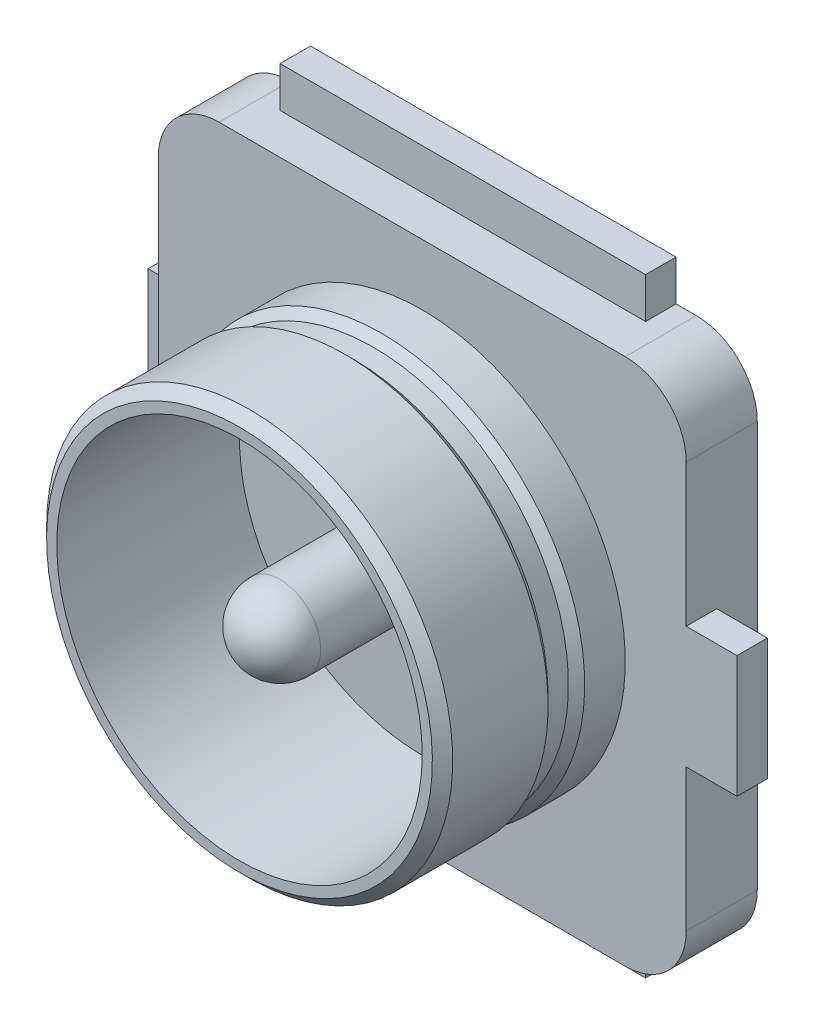
ISO-10303-21;
HEADER;
FILE_DESCRIPTION(('STEP AP214'),'2;1');
FILE_NAME('part.step','',(''),(''),'','','');
FILE_SCHEMA(('AUTOMOTIVE_DESIGN { 1 0 10303 214 1 1 1 1 }'));
ENDSEC;
DATA;
#1=APPLICATION_CONTEXT('core data for automotive mechanical design processes');
#2=APPLICATION_PROTOCOL_DEFINITION('international standard','automotive_design',2000,#1);
#3=PRODUCT_CONTEXT('',#1,'mechanical');
#4=PRODUCT('Part','Part','',(#3));
#5=PRODUCT_RELATED_PRODUCT_CATEGORY('part','',(#4));
#6=PRODUCT_DEFINITION_FORMATION('','',#4);
#7=PRODUCT_DEFINITION_CONTEXT('part definition',#1,'design');
#8=PRODUCT_DEFINITION('design','',#6,#7);
#9=PRODUCT_DEFINITION_SHAPE('','',#8);
#10=(LENGTH_UNIT() NAMED_UNIT(*) SI_UNIT(.MILLI.,.METRE.));
#11=(NAMED_UNIT(*) PLANE_ANGLE_UNIT() SI_UNIT($,.RADIAN.));
#12=(NAMED_UNIT(*) SI_UNIT($,.STERADIAN.) SOLID_ANGLE_UNIT());
#13=UNCERTAINTY_MEASURE_WITH_UNIT(LENGTH_MEASURE(1.E-05),#10,'distance_accuracy_value','');
#14=(GEOMETRIC_REPRESENTATION_CONTEXT(3) GLOBAL_UNCERTAINTY_ASSIGNED_CONTEXT((#13)) GLOBAL_UNIT_ASSIGNED_CONTEXT((#10,
#11,#12)) REPRESENTATION_CONTEXT('',''));
#15=CARTESIAN_POINT('',(0.,0.,0.));
#16=DIRECTION('',(0.,0.,1.));
#17=DIRECTION('',(1.,0.,0.));
#18=AXIS2_PLACEMENT_3D('',#15,#16,#17);
#19=CARTESIAN_POINT('',(1.3,-1.3,0.));
#20=DIRECTION('',(1.,0.,0.));
#21=DIRECTION('',(0.,1.,0.));
#22=AXIS2_PLACEMENT_3D('',#19,#20,#21);
#23=PLANE('',#22);
#24=DIRECTION('',(0.,1.,0.));
#25=VECTOR('',#24,1.);
#26=CARTESIAN_POINT('',(1.3,-1.3,0.2));
#27=LINE('',#26,#25);
#28=CARTESIAN_POINT('',(1.3,0.3,0.2));
#29=VERTEX_POINT('',#28);
#30=CARTESIAN_POINT('',(1.3,-0.3,0.2));
#31=VERTEX_POINT('',#30);
#32=EDGE_CURVE('E103',#29,#31,#27,.F.);
#33=ORIENTED_EDGE('',*,*,#32,.T.);
#34=DIRECTION('',(0.,0.,1.));
#35=VECTOR('',#34,1.);
#36=CARTESIAN_POINT('',(1.3,-0.3,0.));
#37=LINE('',#36,#35);
#38=CARTESIAN_POINT('',(1.3,-0.3,0.35));
#39=VERTEX_POINT('',#38);
#40=EDGE_CURVE('E137',#31,#39,#37,.T.);
#41=ORIENTED_EDGE('',*,*,#40,.T.);
#42=DIRECTION('',(0.,1.,0.));
#43=VECTOR('',#42,1.);
#44=CARTESIAN_POINT('',(1.3,-1.3,0.35));
#45=LINE('',#44,#43);
#46=CARTESIAN_POINT('',(1.3,-1.,0.35));
#47=VERTEX_POINT('',#46);
#48=EDGE_CURVE('E264',#39,#47,#45,.F.);
#49=ORIENTED_EDGE('',*,*,#48,.T.);
#50=DIRECTION('',(0.,0.,1.));
#51=VECTOR('',#50,1.);
#52=CARTESIAN_POINT('',(1.3,-1.,0.));
#53=LINE('',#52,#51);
#54=CARTESIAN_POINT('',(1.3,-1.,0.));
#55=VERTEX_POINT('',#54);
#56=EDGE_CURVE('E262',#47,#55,#53,.F.);
#57=ORIENTED_EDGE('',*,*,#56,.T.);
#58=DIRECTION('',(0.,1.,0.));
#59=VECTOR('',#58,1.);
#60=CARTESIAN_POINT('',(1.3,-1.3,0.));
#61=LINE('',#60,#59);
#62=CARTESIAN_POINT('',(1.3,1.,0.));
#63=VERTEX_POINT('',#62);
#64=EDGE_CURVE('E182',#55,#63,#61,.T.);
#65=ORIENTED_EDGE('',*,*,#64,.T.);
#66=DIRECTION('',(0.,0.,1.));
#67=VECTOR('',#66,1.);
#68=CARTESIAN_POINT('',(1.3,1.,0.));
#69=LINE('',#68,#67);
#70=CARTESIAN_POINT('',(1.3,1.,0.35));
#71=VERTEX_POINT('',#70);
#72=EDGE_CURVE('E117',#63,#71,#69,.T.);
#73=ORIENTED_EDGE('',*,*,#72,.T.);
#74=DIRECTION('',(0.,1.,0.));
#75=VECTOR('',#74,1.);
#76=CARTESIAN_POINT('',(1.3,-1.3,0.35));
#77=LINE('',#76,#75);
#78=CARTESIAN_POINT('',(1.3,0.3,0.35));
#79=VERTEX_POINT('',#78);
#80=EDGE_CURVE('E111',#71,#79,#77,.F.);
#81=ORIENTED_EDGE('',*,*,#80,.T.);
#82=DIRECTION('',(0.,0.,1.));
#83=VECTOR('',#82,1.);
#84=CARTESIAN_POINT('',(1.3,0.3,0.));
#85=LINE('',#84,#83);
#86=EDGE_CURVE('E114',#79,#29,#85,.F.);
#87=ORIENTED_EDGE('',*,*,#86,.T.);
#88=EDGE_LOOP('',(#33,#41,#49,#57,#65,#73,#81,#87));
#89=FACE_BOUND('',#88,.T.);
#90=ADVANCED_FACE('F17',(#89),#23,.T.);
#91=CARTESIAN_POINT('',(-1.55,-0.3,0.));
#92=DIRECTION('',(0.,0.,1.));
#93=DIRECTION('',(1.,0.,0.));
#94=AXIS2_PLACEMENT_3D('',#91,#92,#93);
#95=PLANE('',#94);
#96=DIRECTION('',(-1.,0.,0.));
#97=VECTOR('',#96,1.);
#98=CARTESIAN_POINT('',(-1.55,0.3,0.));
#99=LINE('',#98,#97);
#100=CARTESIAN_POINT('',(-1.3,0.3,0.));
#101=VERTEX_POINT('',#100);
#102=CARTESIAN_POINT('',(-1.55,0.3,0.));
#103=VERTEX_POINT('',#102);
#104=EDGE_CURVE('E224',#101,#103,#99,.T.);
#105=ORIENTED_EDGE('',*,*,#104,.F.);
#106=DIRECTION('',(0.,1.,0.));
#107=VECTOR('',#106,1.);
#108=CARTESIAN_POINT('',(-1.3,-1.3,0.));
#109=LINE('',#108,#107);
#110=CARTESIAN_POINT('',(-1.3,1.,0.));
#111=VERTEX_POINT('',#110);
#112=EDGE_CURVE('E177',#111,#101,#109,.F.);
#113=ORIENTED_EDGE('',*,*,#112,.F.);
#114=CARTESIAN_POINT('',(-1.,1.,0.));
#115=DIRECTION('',(0.,0.,1.));
#116=DIRECTION('',(1.,0.,0.));
#117=AXIS2_PLACEMENT_3D('',#114,#115,#116);
#118=CIRCLE('',#117,0.3);
#119=CARTESIAN_POINT('',(-1.,1.3,0.));
#120=VERTEX_POINT('',#119);
#121=EDGE_CURVE('E174',#120,#111,#118,.T.);
#122=ORIENTED_EDGE('',*,*,#121,.F.);
#123=DIRECTION('',(1.,0.,0.));
#124=VECTOR('',#123,1.);
#125=CARTESIAN_POINT('',(-1.3,1.3,0.));
#126=LINE('',#125,#124);
#127=CARTESIAN_POINT('',(-0.9,1.3,0.));
#128=VERTEX_POINT('',#127);
#129=EDGE_CURVE('E178',#128,#120,#126,.F.);
#130=ORIENTED_EDGE('',*,*,#129,.F.);
#131=DIRECTION('',(0.,1.,0.));
#132=VECTOR('',#131,1.);
#133=CARTESIAN_POINT('',(-0.9,1.1,0.));
#134=LINE('',#133,#132);
#135=CARTESIAN_POINT('',(-0.9,1.5,0.));
#136=VERTEX_POINT('',#135);
#137=EDGE_CURVE('E244',#136,#128,#134,.F.);
#138=ORIENTED_EDGE('',*,*,#137,.F.);
#139=DIRECTION('',(-1.,0.,0.));
#140=VECTOR('',#139,1.);
#141=CARTESIAN_POINT('',(-0.9,1.5,0.));
#142=LINE('',#141,#140);
#143=CARTESIAN_POINT('',(0.9,1.5,0.));
#144=VERTEX_POINT('',#143);
#145=EDGE_CURVE('E369',#144,#136,#142,.T.);
#146=ORIENTED_EDGE('',*,*,#145,.F.);
#147=DIRECTION('',(0.,1.,0.));
#148=VECTOR('',#147,1.);
#149=CARTESIAN_POINT('',(0.9,1.1,0.));
#150=LINE('',#149,#148);
#151=CARTESIAN_POINT('',(0.9,1.3,0.));
#152=VERTEX_POINT('',#151);
#153=EDGE_CURVE('E248',#152,#144,#150,.T.);
#154=ORIENTED_EDGE('',*,*,#153,.F.);
#155=DIRECTION('',(1.,0.,0.));
#156=VECTOR('',#155,1.);
#157=CARTESIAN_POINT('',(-1.3,1.3,0.));
#158=LINE('',#157,#156);
#159=CARTESIAN_POINT('',(1.,1.3,0.));
#160=VERTEX_POINT('',#159);
#161=EDGE_CURVE('E181',#160,#152,#158,.F.);
#162=ORIENTED_EDGE('',*,*,#161,.F.);
#163=CARTESIAN_POINT('',(1.,1.,0.));
#164=DIRECTION('',(0.,0.,1.));
#165=DIRECTION('',(1.,0.,0.));
#166=AXIS2_PLACEMENT_3D('',#163,#164,#165);
#167=CIRCLE('',#166,0.3);
#168=EDGE_CURVE('E179',#63,#160,#167,.T.);
#169=ORIENTED_EDGE('',*,*,#168,.F.);
#170=ORIENTED_EDGE('',*,*,#64,.F.);
#171=CARTESIAN_POINT('',(1.,-1.,0.));
#172=DIRECTION('',(0.,0.,1.));
#173=DIRECTION('',(1.,0.,0.));
#174=AXIS2_PLACEMENT_3D('',#171,#172,#173);
#175=CIRCLE('',#174,0.3);
#176=CARTESIAN_POINT('',(1.,-1.3,0.));
#177=VERTEX_POINT('',#176);
#178=EDGE_CURVE('E183',#177,#55,#175,.T.);
#179=ORIENTED_EDGE('',*,*,#178,.F.);
#180=DIRECTION('',(1.,0.,0.));
#181=VECTOR('',#180,1.);
#182=CARTESIAN_POINT('',(-1.3,-1.3,0.));
#183=LINE('',#182,#181);
#184=CARTESIAN_POINT('',(0.9,-1.3,0.));
#185=VERTEX_POINT('',#184);
#186=EDGE_CURVE('E185',#185,#177,#183,.T.);
#187=ORIENTED_EDGE('',*,*,#186,.F.);
#188=DIRECTION('',(0.,1.,0.));
#189=VECTOR('',#188,1.);
#190=CARTESIAN_POINT('',(0.9,-1.5,0.));
#191=LINE('',#190,#189);
#192=CARTESIAN_POINT('',(0.9,-1.5,0.));
#193=VERTEX_POINT('',#192);
#194=EDGE_CURVE('E259',#193,#185,#191,.T.);
#195=ORIENTED_EDGE('',*,*,#194,.F.);
#196=DIRECTION('',(-1.,0.,0.));
#197=VECTOR('',#196,1.);
#198=CARTESIAN_POINT('',(-0.9,-1.5,0.));
#199=LINE('',#198,#197);
#200=CARTESIAN_POINT('',(-0.9,-1.5,0.));
#201=VERTEX_POINT('',#200);
#202=EDGE_CURVE('E375',#193,#201,#199,.T.);
#203=ORIENTED_EDGE('',*,*,#202,.T.);
#204=DIRECTION('',(0.,1.,0.));
#205=VECTOR('',#204,1.);
#206=CARTESIAN_POINT('',(-0.9,-1.5,0.));
#207=LINE('',#206,#205);
#208=CARTESIAN_POINT('',(-0.9,-1.3,0.));
#209=VERTEX_POINT('',#208);
#210=EDGE_CURVE('E275',#209,#201,#207,.F.);
#211=ORIENTED_EDGE('',*,*,#210,.F.);
#212=DIRECTION('',(1.,0.,0.));
#213=VECTOR('',#212,1.);
#214=CARTESIAN_POINT('',(-1.3,-1.3,0.));
#215=LINE('',#214,#213);
#216=CARTESIAN_POINT('',(-1.,-1.3,0.));
#217=VERTEX_POINT('',#216);
#218=EDGE_CURVE('E191',#217,#209,#215,.T.);
#219=ORIENTED_EDGE('',*,*,#218,.F.);
#220=CARTESIAN_POINT('',(-1.,-1.,0.));
#221=DIRECTION('',(0.,0.,1.));
#222=DIRECTION('',(1.,0.,0.));
#223=AXIS2_PLACEMENT_3D('',#220,#221,#222);
#224=CIRCLE('',#223,0.3);
#225=CARTESIAN_POINT('',(-1.3,-1.,0.));
#226=VERTEX_POINT('',#225);
#227=EDGE_CURVE('E20',#226,#217,#224,.T.);
#228=ORIENTED_EDGE('',*,*,#227,.F.);
#229=DIRECTION('',(0.,1.,0.));
#230=VECTOR('',#229,1.);
#231=CARTESIAN_POINT('',(-1.3,-1.3,0.));
#232=LINE('',#231,#230);
#233=CARTESIAN_POINT('',(-1.3,-0.3,0.));
#234=VERTEX_POINT('',#233);
#235=EDGE_CURVE('E205',#234,#226,#232,.F.);
#236=ORIENTED_EDGE('',*,*,#235,.F.);
#237=DIRECTION('',(-1.,0.,0.));
#238=VECTOR('',#237,1.);
#239=CARTESIAN_POINT('',(-1.55,-0.3,0.));
#240=LINE('',#239,#238);
#241=CARTESIAN_POINT('',(-1.55,-0.3,0.));
#242=VERTEX_POINT('',#241);
#243=EDGE_CURVE('E210',#234,#242,#240,.T.);
#244=ORIENTED_EDGE('',*,*,#243,.T.);
#245=DIRECTION('',(0.,1.,0.));
#246=VECTOR('',#245,1.);
#247=CARTESIAN_POINT('',(-1.55,-0.3,0.));
#248=LINE('',#247,#246);
#249=EDGE_CURVE('E247',#242,#103,#248,.T.);
#250=ORIENTED_EDGE('',*,*,#249,.T.);
#251=EDGE_LOOP('',(#105,#113,#122,#130,#138,#146,#154,#162,#169,#170,#179,#187,#195,#203,#211,
#219,#228,#236,#244,#250));
#252=FACE_BOUND('',#251,.T.);
#253=ADVANCED_FACE('F401',(#252),#95,.F.);
#254=CARTESIAN_POINT('',(-1.55,-0.3,0.));
#255=DIRECTION('',(1.,0.,0.));
#256=DIRECTION('',(0.,1.,0.));
#257=AXIS2_PLACEMENT_3D('',#254,#255,#256);
#258=PLANE('',#257);
#259=DIRECTION('',(0.,0.,1.));
#260=VECTOR('',#259,1.);
#261=CARTESIAN_POINT('',(-1.55,0.3,0.));
#262=LINE('',#261,#260);
#263=CARTESIAN_POINT('',(-1.55,0.3,0.15));
#264=VERTEX_POINT('',#263);
#265=EDGE_CURVE('E227',#103,#264,#262,.T.);
#266=ORIENTED_EDGE('',*,*,#265,.F.);
#267=ORIENTED_EDGE('',*,*,#249,.F.);
#268=DIRECTION('',(0.,0.,1.));
#269=VECTOR('',#268,1.);
#270=CARTESIAN_POINT('',(-1.55,-0.3,0.));
#271=LINE('',#270,#269);
#272=CARTESIAN_POINT('',(-1.55,-0.3,0.15));
#273=VERTEX_POINT('',#272);
#274=EDGE_CURVE('E213',#242,#273,#271,.T.);
#275=ORIENTED_EDGE('',*,*,#274,.T.);
#276=DIRECTION('',(0.,1.,0.));
#277=VECTOR('',#276,1.);
#278=CARTESIAN_POINT('',(-1.55,-0.3,0.15));
#279=LINE('',#278,#277);
#280=EDGE_CURVE('E362',#264,#273,#279,.F.);
#281=ORIENTED_EDGE('',*,*,#280,.F.);
#282=EDGE_LOOP('',(#266,#267,#275,#281));
#283=FACE_BOUND('',#282,.T.);
#284=ADVANCED_FACE('F473',(#283),#258,.F.);
#285=CARTESIAN_POINT('',(-0.9,-1.5,0.));
#286=DIRECTION('',(0.,1.,0.));
#287=DIRECTION('',(-1.,0.,0.));
#288=AXIS2_PLACEMENT_3D('',#285,#286,#287);
#289=PLANE('',#288);
#290=DIRECTION('',(1.,0.,0.));
#291=VECTOR('',#290,1.);
#292=CARTESIAN_POINT('',(-0.9,-1.5,0.15));
#293=LINE('',#292,#291);
#294=CARTESIAN_POINT('',(-0.9,-1.5,0.15));
#295=VERTEX_POINT('',#294);
#296=CARTESIAN_POINT('',(0.9,-1.5,0.15));
#297=VERTEX_POINT('',#296);
#298=EDGE_CURVE('E349',#295,#297,#293,.T.);
#299=ORIENTED_EDGE('',*,*,#298,.F.);
#300=DIRECTION('',(0.,0.,1.));
#301=VECTOR('',#300,1.);
#302=CARTESIAN_POINT('',(-0.9,-1.5,0.));
#303=LINE('',#302,#301);
#304=EDGE_CURVE('E372',#201,#295,#303,.T.);
#305=ORIENTED_EDGE('',*,*,#304,.F.);
#306=ORIENTED_EDGE('',*,*,#202,.F.);
#307=DIRECTION('',(0.,0.,1.));
#308=VECTOR('',#307,1.);
#309=CARTESIAN_POINT('',(0.9,-1.5,0.));
#310=LINE('',#309,#308);
#311=EDGE_CURVE('E352',#297,#193,#310,.F.);
#312=ORIENTED_EDGE('',*,*,#311,.F.);
#313=EDGE_LOOP('',(#299,#305,#306,#312));
#314=FACE_BOUND('',#313,.T.);
#315=ADVANCED_FACE('F510',(#314),#289,.F.);
#316=CARTESIAN_POINT('',(-0.9,1.5,0.));
#317=DIRECTION('',(0.,1.,0.));
#318=DIRECTION('',(-1.,0.,0.));
#319=AXIS2_PLACEMENT_3D('',#316,#317,#318);
#320=PLANE('',#319);
#321=DIRECTION('',(1.,0.,0.));
#322=VECTOR('',#321,1.);
#323=CARTESIAN_POINT('',(-0.9,1.5,0.15));
#324=LINE('',#323,#322);
#325=CARTESIAN_POINT('',(0.9,1.5,0.15));
#326=VERTEX_POINT('',#325);
#327=CARTESIAN_POINT('',(-0.9,1.5,0.15));
#328=VERTEX_POINT('',#327);
#329=EDGE_CURVE('E334',#326,#328,#324,.F.);
#330=ORIENTED_EDGE('',*,*,#329,.F.);
#331=DIRECTION('',(0.,0.,1.));
#332=VECTOR('',#331,1.);
#333=CARTESIAN_POINT('',(0.9,1.5,0.));
#334=LINE('',#333,#332);
#335=EDGE_CURVE('E340',#144,#326,#334,.T.);
#336=ORIENTED_EDGE('',*,*,#335,.F.);
#337=ORIENTED_EDGE('',*,*,#145,.T.);
#338=DIRECTION('',(0.,0.,1.));
#339=VECTOR('',#338,1.);
#340=CARTESIAN_POINT('',(-0.9,1.5,0.));
#341=LINE('',#340,#339);
#342=EDGE_CURVE('E214',#136,#328,#341,.T.);
#343=ORIENTED_EDGE('',*,*,#342,.T.);
#344=EDGE_LOOP('',(#330,#336,#337,#343));
#345=FACE_BOUND('',#344,.T.);
#346=ADVANCED_FACE('F487',(#345),#320,.T.);
#347=CARTESIAN_POINT('',(-1.55,-0.3,0.));
#348=DIRECTION('',(0.,1.,0.));
#349=DIRECTION('',(-1.,0.,0.));
#350=AXIS2_PLACEMENT_3D('',#347,#348,#349);
#351=PLANE('',#350);
#352=DIRECTION('',(1.,0.,0.));
#353=VECTOR('',#352,1.);
#354=CARTESIAN_POINT('',(-1.55,-0.3,0.15));
#355=LINE('',#354,#353);
#356=CARTESIAN_POINT('',(-1.3,-0.3,0.15));
#357=VERTEX_POINT('',#356);
#358=EDGE_CURVE('E228',#273,#357,#355,.T.);
#359=ORIENTED_EDGE('',*,*,#358,.F.);
#360=ORIENTED_EDGE('',*,*,#274,.F.);
#361=ORIENTED_EDGE('',*,*,#243,.F.);
#362=DIRECTION('',(0.,0.,1.));
#363=VECTOR('',#362,1.);
#364=CARTESIAN_POINT('',(-1.3,-0.3,0.));
#365=LINE('',#364,#363);
#366=EDGE_CURVE('E217',#234,#357,#365,.T.);
#367=ORIENTED_EDGE('',*,*,#366,.T.);
#368=EDGE_LOOP('',(#359,#360,#361,#367));
#369=FACE_BOUND('',#368,.T.);
#370=ADVANCED_FACE('F469',(#369),#351,.F.);
#371=CARTESIAN_POINT('',(-1.55,-0.3,0.15));
#372=DIRECTION('',(0.,0.,1.));
#373=DIRECTION('',(1.,0.,0.));
#374=AXIS2_PLACEMENT_3D('',#371,#372,#373);
#375=PLANE('',#374);
#376=ORIENTED_EDGE('',*,*,#358,.T.);
#377=DIRECTION('',(0.,1.,0.));
#378=VECTOR('',#377,1.);
#379=CARTESIAN_POINT('',(-1.3,-1.3,0.15));
#380=LINE('',#379,#378);
#381=CARTESIAN_POINT('',(-1.3,0.3,0.15));
#382=VERTEX_POINT('',#381);
#383=EDGE_CURVE('E220',#357,#382,#380,.T.);
#384=ORIENTED_EDGE('',*,*,#383,.T.);
#385=DIRECTION('',(-1.,0.,0.));
#386=VECTOR('',#385,1.);
#387=CARTESIAN_POINT('',(-1.55,0.3,0.15));
#388=LINE('',#387,#386);
#389=EDGE_CURVE('E355',#264,#382,#388,.F.);
#390=ORIENTED_EDGE('',*,*,#389,.F.);
#391=ORIENTED_EDGE('',*,*,#280,.T.);
#392=EDGE_LOOP('',(#376,#384,#390,#391));
#393=FACE_BOUND('',#392,.T.);
#394=ADVANCED_FACE('F481',(#393),#375,.T.);
#395=CARTESIAN_POINT('',(-1.55,0.3,0.));
#396=DIRECTION('',(0.,1.,0.));
#397=DIRECTION('',(-1.,0.,0.));
#398=AXIS2_PLACEMENT_3D('',#395,#396,#397);
#399=PLANE('',#398);
#400=ORIENTED_EDGE('',*,*,#389,.T.);
#401=DIRECTION('',(0.,0.,1.));
#402=VECTOR('',#401,1.);
#403=CARTESIAN_POINT('',(-1.3,0.3,0.));
#404=LINE('',#403,#402);
#405=EDGE_CURVE('E231',#382,#101,#404,.F.);
#406=ORIENTED_EDGE('',*,*,#405,.T.);
#407=ORIENTED_EDGE('',*,*,#104,.T.);
#408=ORIENTED_EDGE('',*,*,#265,.T.);
#409=EDGE_LOOP('',(#400,#406,#407,#408));
#410=FACE_BOUND('',#409,.T.);
#411=ADVANCED_FACE('F478',(#410),#399,.T.);
#412=CARTESIAN_POINT('',(0.9,-1.5,0.));
#413=DIRECTION('',(1.,0.,0.));
#414=DIRECTION('',(0.,1.,0.));
#415=AXIS2_PLACEMENT_3D('',#412,#413,#414);
#416=PLANE('',#415);
#417=ORIENTED_EDGE('',*,*,#194,.T.);
#418=DIRECTION('',(0.,0.,1.));
#419=VECTOR('',#418,1.);
#420=CARTESIAN_POINT('',(0.9,-1.3,0.));
#421=LINE('',#420,#419);
#422=CARTESIAN_POINT('',(0.9,-1.3,0.15));
#423=VERTEX_POINT('',#422);
#424=EDGE_CURVE('E266',#185,#423,#421,.T.);
#425=ORIENTED_EDGE('',*,*,#424,.T.);
#426=DIRECTION('',(0.,1.,0.));
#427=VECTOR('',#426,1.);
#428=CARTESIAN_POINT('',(0.9,-1.5,0.15));
#429=LINE('',#428,#427);
#430=EDGE_CURVE('E346',#297,#423,#429,.T.);
#431=ORIENTED_EDGE('',*,*,#430,.F.);
#432=ORIENTED_EDGE('',*,*,#311,.T.);
#433=EDGE_LOOP('',(#417,#425,#431,#432));
#434=FACE_BOUND('',#433,.T.);
#435=ADVANCED_FACE('F508',(#434),#416,.T.);
#436=CARTESIAN_POINT('',(-0.9,-1.5,0.15));
#437=DIRECTION('',(0.,0.,1.));
#438=DIRECTION('',(1.,0.,0.));
#439=AXIS2_PLACEMENT_3D('',#436,#437,#438);
#440=PLANE('',#439);
#441=ORIENTED_EDGE('',*,*,#430,.T.);
#442=DIRECTION('',(-1.,0.,0.));
#443=VECTOR('',#442,1.);
#444=CARTESIAN_POINT('',(-1.3,-1.3,0.15));
#445=LINE('',#444,#443);
#446=CARTESIAN_POINT('',(-0.9,-1.3,0.15));
#447=VERTEX_POINT('',#446);
#448=EDGE_CURVE('E269',#423,#447,#445,.T.);
#449=ORIENTED_EDGE('',*,*,#448,.T.);
#450=DIRECTION('',(0.,1.,0.));
#451=VECTOR('',#450,1.);
#452=CARTESIAN_POINT('',(-0.9,-1.5,0.15));
#453=LINE('',#452,#451);
#454=EDGE_CURVE('E343',#447,#295,#453,.F.);
#455=ORIENTED_EDGE('',*,*,#454,.T.);
#456=ORIENTED_EDGE('',*,*,#298,.T.);
#457=EDGE_LOOP('',(#441,#449,#455,#456));
#458=FACE_BOUND('',#457,.T.);
#459=ADVANCED_FACE('F504',(#458),#440,.T.);
#460=CARTESIAN_POINT('',(-0.9,-1.5,0.));
#461=DIRECTION('',(1.,0.,0.));
#462=DIRECTION('',(0.,1.,0.));
#463=AXIS2_PLACEMENT_3D('',#460,#461,#462);
#464=PLANE('',#463);
#465=ORIENTED_EDGE('',*,*,#210,.T.);
#466=ORIENTED_EDGE('',*,*,#304,.T.);
#467=ORIENTED_EDGE('',*,*,#454,.F.);
#468=DIRECTION('',(0.,0.,1.));
#469=VECTOR('',#468,1.);
#470=CARTESIAN_POINT('',(-0.9,-1.3,0.));
#471=LINE('',#470,#469);
#472=EDGE_CURVE('E282',#447,#209,#471,.F.);
#473=ORIENTED_EDGE('',*,*,#472,.T.);
#474=EDGE_LOOP('',(#465,#466,#467,#473));
#475=FACE_BOUND('',#474,.T.);
#476=ADVANCED_FACE('F450',(#475),#464,.F.);
#477=CARTESIAN_POINT('',(0.9,1.1,0.));
#478=DIRECTION('',(1.,0.,0.));
#479=DIRECTION('',(0.,1.,0.));
#480=AXIS2_PLACEMENT_3D('',#477,#478,#479);
#481=PLANE('',#480);
#482=ORIENTED_EDGE('',*,*,#335,.T.);
#483=DIRECTION('',(0.,1.,0.));
#484=VECTOR('',#483,1.);
#485=CARTESIAN_POINT('',(0.9,1.1,0.15));
#486=LINE('',#485,#484);
#487=CARTESIAN_POINT('',(0.9,1.3,0.15));
#488=VERTEX_POINT('',#487);
#489=EDGE_CURVE('E337',#488,#326,#486,.T.);
#490=ORIENTED_EDGE('',*,*,#489,.F.);
#491=DIRECTION('',(0.,0.,1.));
#492=VECTOR('',#491,1.);
#493=CARTESIAN_POINT('',(0.9,1.3,0.));
#494=LINE('',#493,#492);
#495=EDGE_CURVE('E251',#152,#488,#494,.T.);
#496=ORIENTED_EDGE('',*,*,#495,.F.);
#497=ORIENTED_EDGE('',*,*,#153,.T.);
#498=EDGE_LOOP('',(#482,#490,#496,#497));
#499=FACE_BOUND('',#498,.T.);
#500=ADVANCED_FACE('F408',(#499),#481,.T.);
#501=CARTESIAN_POINT('',(-0.9,1.1,0.15));
#502=DIRECTION('',(0.,0.,1.));
#503=DIRECTION('',(1.,0.,0.));
#504=AXIS2_PLACEMENT_3D('',#501,#502,#503);
#505=PLANE('',#504);
#506=ORIENTED_EDGE('',*,*,#489,.T.);
#507=ORIENTED_EDGE('',*,*,#329,.T.);
#508=DIRECTION('',(0.,1.,0.));
#509=VECTOR('',#508,1.);
#510=CARTESIAN_POINT('',(-0.9,1.1,0.15));
#511=LINE('',#510,#509);
#512=CARTESIAN_POINT('',(-0.9,1.3,0.15));
#513=VERTEX_POINT('',#512);
#514=EDGE_CURVE('E221',#328,#513,#511,.F.);
#515=ORIENTED_EDGE('',*,*,#514,.T.);
#516=DIRECTION('',(-1.,0.,0.));
#517=VECTOR('',#516,1.);
#518=CARTESIAN_POINT('',(-1.3,1.3,0.15));
#519=LINE('',#518,#517);
#520=EDGE_CURVE('E241',#488,#513,#519,.T.);
#521=ORIENTED_EDGE('',*,*,#520,.F.);
#522=EDGE_LOOP('',(#506,#507,#515,#521));
#523=FACE_BOUND('',#522,.T.);
#524=ADVANCED_FACE('F491',(#523),#505,.T.);
#525=CARTESIAN_POINT('',(-0.9,1.1,0.));
#526=DIRECTION('',(1.,0.,0.));
#527=DIRECTION('',(0.,1.,0.));
#528=AXIS2_PLACEMENT_3D('',#525,#526,#527);
#529=PLANE('',#528);
#530=ORIENTED_EDGE('',*,*,#342,.F.);
#531=ORIENTED_EDGE('',*,*,#137,.T.);
#532=DIRECTION('',(0.,0.,1.));
#533=VECTOR('',#532,1.);
#534=CARTESIAN_POINT('',(-0.9,1.3,0.));
#535=LINE('',#534,#533);
#536=EDGE_CURVE('E237',#513,#128,#535,.F.);
#537=ORIENTED_EDGE('',*,*,#536,.F.);
#538=ORIENTED_EDGE('',*,*,#514,.F.);
#539=EDGE_LOOP('',(#530,#531,#537,#538));
#540=FACE_BOUND('',#539,.T.);
#541=ADVANCED_FACE('F495',(#540),#529,.F.);
#542=CARTESIAN_POINT('',(0.95,-0.3,0.2));
#543=DIRECTION('',(0.,0.,1.));
#544=DIRECTION('',(1.,0.,0.));
#545=AXIS2_PLACEMENT_3D('',#542,#543,#544);
#546=PLANE('',#545);
#547=DIRECTION('',(0.,1.,0.));
#548=VECTOR('',#547,1.);
#549=CARTESIAN_POINT('',(1.55,-0.3,0.2));
#550=LINE('',#549,#548);
#551=CARTESIAN_POINT('',(1.55,-0.3,0.2));
#552=VERTEX_POINT('',#551);
#553=CARTESIAN_POINT('',(1.55,0.3,0.2));
#554=VERTEX_POINT('',#553);
#555=EDGE_CURVE('E302',#552,#554,#550,.T.);
#556=ORIENTED_EDGE('',*,*,#555,.F.);
#557=DIRECTION('',(-1.,0.,0.));
#558=VECTOR('',#557,1.);
#559=CARTESIAN_POINT('',(0.95,-0.3,0.2));
#560=LINE('',#559,#558);
#561=EDGE_CURVE('E294',#552,#31,#560,.T.);
#562=ORIENTED_EDGE('',*,*,#561,.T.);
#563=ORIENTED_EDGE('',*,*,#32,.F.);
#564=DIRECTION('',(-1.,0.,0.));
#565=VECTOR('',#564,1.);
#566=CARTESIAN_POINT('',(0.95,0.3,0.2));
#567=LINE('',#566,#565);
#568=EDGE_CURVE('E135',#554,#29,#567,.T.);
#569=ORIENTED_EDGE('',*,*,#568,.F.);
#570=EDGE_LOOP('',(#556,#562,#563,#569));
#571=FACE_BOUND('',#570,.T.);
#572=ADVANCED_FACE('F592',(#571),#546,.F.);
#573=CARTESIAN_POINT('',(-1.3,-1.3,0.));
#574=DIRECTION('',(1.,0.,0.));
#575=DIRECTION('',(0.,1.,0.));
#576=AXIS2_PLACEMENT_3D('',#573,#574,#575);
#577=PLANE('',#576);
#578=ORIENTED_EDGE('',*,*,#112,.T.);
#579=ORIENTED_EDGE('',*,*,#405,.F.);
#580=ORIENTED_EDGE('',*,*,#383,.F.);
#581=ORIENTED_EDGE('',*,*,#366,.F.);
#582=ORIENTED_EDGE('',*,*,#235,.T.);
#583=DIRECTION('',(0.,0.,1.));
#584=VECTOR('',#583,1.);
#585=CARTESIAN_POINT('',(-1.3,-1.,0.));
#586=LINE('',#585,#584);
#587=CARTESIAN_POINT('',(-1.3,-1.,0.35));
#588=VERTEX_POINT('',#587);
#589=EDGE_CURVE('E234',#588,#226,#586,.F.);
#590=ORIENTED_EDGE('',*,*,#589,.F.);
#591=DIRECTION('',(0.,1.,0.));
#592=VECTOR('',#591,1.);
#593=CARTESIAN_POINT('',(-1.3,-1.3,0.35));
#594=LINE('',#593,#592);
#595=CARTESIAN_POINT('',(-1.3,1.,0.35));
#596=VERTEX_POINT('',#595);
#597=EDGE_CURVE('E173',#596,#588,#594,.F.);
#598=ORIENTED_EDGE('',*,*,#597,.F.);
#599=DIRECTION('',(0.,0.,1.));
#600=VECTOR('',#599,1.);
#601=CARTESIAN_POINT('',(-1.3,1.,0.));
#602=LINE('',#601,#600);
#603=EDGE_CURVE('E240',#111,#596,#602,.T.);
#604=ORIENTED_EDGE('',*,*,#603,.F.);
#605=EDGE_LOOP('',(#578,#579,#580,#581,#582,#590,#598,#604));
#606=FACE_BOUND('',#605,.T.);
#607=ADVANCED_FACE('F462',(#606),#577,.F.);
#608=CARTESIAN_POINT('',(-1.,-1.,0.));
#609=DIRECTION('',(0.,0.,1.));
#610=DIRECTION('',(1.,0.,0.));
#611=AXIS2_PLACEMENT_3D('',#608,#609,#610);
#612=CYLINDRICAL_SURFACE('',#611,0.3);
#613=CARTESIAN_POINT('',(-1.,-1.,0.35));
#614=DIRECTION('',(0.,0.,1.));
#615=DIRECTION('',(1.,0.,0.));
#616=AXIS2_PLACEMENT_3D('',#613,#614,#615);
#617=CIRCLE('',#616,0.3);
#618=CARTESIAN_POINT('',(-1.,-1.3,0.35));
#619=VERTEX_POINT('',#618);
#620=EDGE_CURVE('E171',#588,#619,#617,.T.);
#621=ORIENTED_EDGE('',*,*,#620,.F.);
#622=ORIENTED_EDGE('',*,*,#589,.T.);
#623=ORIENTED_EDGE('',*,*,#227,.T.);
#624=DIRECTION('',(0.,0.,1.));
#625=VECTOR('',#624,1.);
#626=CARTESIAN_POINT('',(-1.,-1.3,0.));
#627=LINE('',#626,#625);
#628=EDGE_CURVE('E270',#217,#619,#627,.T.);
#629=ORIENTED_EDGE('',*,*,#628,.T.);
#630=EDGE_LOOP('',(#621,#622,#623,#629));
#631=FACE_BOUND('',#630,.T.);
#632=ADVANCED_FACE('F457',(#631),#612,.T.);
#633=CARTESIAN_POINT('',(-1.3,-1.3,0.));
#634=DIRECTION('',(0.,1.,0.));
#635=DIRECTION('',(-1.,0.,0.));
#636=AXIS2_PLACEMENT_3D('',#633,#634,#635);
#637=PLANE('',#636);
#638=ORIENTED_EDGE('',*,*,#448,.F.);
#639=ORIENTED_EDGE('',*,*,#424,.F.);
#640=ORIENTED_EDGE('',*,*,#186,.T.);
#641=DIRECTION('',(0.,0.,1.));
#642=VECTOR('',#641,1.);
#643=CARTESIAN_POINT('',(1.,-1.3,0.));
#644=LINE('',#643,#642);
#645=CARTESIAN_POINT('',(1.,-1.3,0.35));
#646=VERTEX_POINT('',#645);
#647=EDGE_CURVE('E285',#646,#177,#644,.F.);
#648=ORIENTED_EDGE('',*,*,#647,.F.);
#649=DIRECTION('',(1.,0.,0.));
#650=VECTOR('',#649,1.);
#651=CARTESIAN_POINT('',(-1.3,-1.3,0.35));
#652=LINE('',#651,#650);
#653=EDGE_CURVE('E170',#619,#646,#652,.T.);
#654=ORIENTED_EDGE('',*,*,#653,.F.);
#655=ORIENTED_EDGE('',*,*,#628,.F.);
#656=ORIENTED_EDGE('',*,*,#218,.T.);
#657=ORIENTED_EDGE('',*,*,#472,.F.);
#658=EDGE_LOOP('',(#638,#639,#640,#648,#654,#655,#656,#657));
#659=FACE_BOUND('',#658,.T.);
#660=ADVANCED_FACE('F453',(#659),#637,.F.);
#661=CARTESIAN_POINT('',(1.,-1.,0.));
#662=DIRECTION('',(0.,0.,1.));
#663=DIRECTION('',(1.,0.,0.));
#664=AXIS2_PLACEMENT_3D('',#661,#662,#663);
#665=CYLINDRICAL_SURFACE('',#664,0.3);
#666=ORIENTED_EDGE('',*,*,#647,.T.);
#667=ORIENTED_EDGE('',*,*,#178,.T.);
#668=ORIENTED_EDGE('',*,*,#56,.F.);
#669=CARTESIAN_POINT('',(1.,-1.,0.35));
#670=DIRECTION('',(0.,0.,1.));
#671=DIRECTION('',(1.,0.,0.));
#672=AXIS2_PLACEMENT_3D('',#669,#670,#671);
#673=CIRCLE('',#672,0.3);
#674=EDGE_CURVE('E167',#646,#47,#673,.T.);
#675=ORIENTED_EDGE('',*,*,#674,.F.);
#676=EDGE_LOOP('',(#666,#667,#668,#675));
#677=FACE_BOUND('',#676,.T.);
#678=ADVANCED_FACE('F576',(#677),#665,.T.);
#679=CARTESIAN_POINT('',(1.,1.,0.));
#680=DIRECTION('',(0.,0.,1.));
#681=DIRECTION('',(1.,0.,0.));
#682=AXIS2_PLACEMENT_3D('',#679,#680,#681);
#683=CYLINDRICAL_SURFACE('',#682,0.3);
#684=CARTESIAN_POINT('',(1.,1.,0.35));
#685=DIRECTION('',(0.,0.,1.));
#686=DIRECTION('',(1.,0.,0.));
#687=AXIS2_PLACEMENT_3D('',#684,#685,#686);
#688=CIRCLE('',#687,0.3);
#689=CARTESIAN_POINT('',(1.,1.3,0.35));
#690=VERTEX_POINT('',#689);
#691=EDGE_CURVE('E165',#71,#690,#688,.T.);
#692=ORIENTED_EDGE('',*,*,#691,.F.);
#693=ORIENTED_EDGE('',*,*,#72,.F.);
#694=ORIENTED_EDGE('',*,*,#168,.T.);
#695=DIRECTION('',(0.,0.,1.));
#696=VECTOR('',#695,1.);
#697=CARTESIAN_POINT('',(1.,1.3,0.));
#698=LINE('',#697,#696);
#699=EDGE_CURVE('E254',#690,#160,#698,.F.);
#700=ORIENTED_EDGE('',*,*,#699,.F.);
#701=EDGE_LOOP('',(#692,#693,#694,#700));
#702=FACE_BOUND('',#701,.T.);
#703=ADVANCED_FACE('F574',(#702),#683,.T.);
#704=CARTESIAN_POINT('',(-1.3,1.3,0.));
#705=DIRECTION('',(0.,1.,0.));
#706=DIRECTION('',(-1.,0.,0.));
#707=AXIS2_PLACEMENT_3D('',#704,#705,#706);
#708=PLANE('',#707);
#709=ORIENTED_EDGE('',*,*,#520,.T.);
#710=ORIENTED_EDGE('',*,*,#536,.T.);
#711=ORIENTED_EDGE('',*,*,#129,.T.);
#712=DIRECTION('',(0.,0.,1.));
#713=VECTOR('',#712,1.);
#714=CARTESIAN_POINT('',(-1.,1.3,0.));
#715=LINE('',#714,#713);
#716=CARTESIAN_POINT('',(-1.,1.3,0.35));
#717=VERTEX_POINT('',#716);
#718=EDGE_CURVE('E297',#717,#120,#715,.F.);
#719=ORIENTED_EDGE('',*,*,#718,.F.);
#720=DIRECTION('',(1.,0.,0.));
#721=VECTOR('',#720,1.);
#722=CARTESIAN_POINT('',(-1.3,1.3,0.35));
#723=LINE('',#722,#721);
#724=EDGE_CURVE('E164',#690,#717,#723,.F.);
#725=ORIENTED_EDGE('',*,*,#724,.F.);
#726=ORIENTED_EDGE('',*,*,#699,.T.);
#727=ORIENTED_EDGE('',*,*,#161,.T.);
#728=ORIENTED_EDGE('',*,*,#495,.T.);
#729=EDGE_LOOP('',(#709,#710,#711,#719,#725,#726,#727,#728));
#730=FACE_BOUND('',#729,.T.);
#731=ADVANCED_FACE('F391',(#730),#708,.T.);
#732=CARTESIAN_POINT('',(-1.,1.,0.));
#733=DIRECTION('',(0.,0.,1.));
#734=DIRECTION('',(1.,0.,0.));
#735=AXIS2_PLACEMENT_3D('',#732,#733,#734);
#736=CYLINDRICAL_SURFACE('',#735,0.3);
#737=ORIENTED_EDGE('',*,*,#718,.T.);
#738=ORIENTED_EDGE('',*,*,#121,.T.);
#739=ORIENTED_EDGE('',*,*,#603,.T.);
#740=CARTESIAN_POINT('',(-1.,1.,0.35));
#741=DIRECTION('',(0.,0.,1.));
#742=DIRECTION('',(1.,0.,0.));
#743=AXIS2_PLACEMENT_3D('',#740,#741,#742);
#744=CIRCLE('',#743,0.3);
#745=EDGE_CURVE('E160',#717,#596,#744,.T.);
#746=ORIENTED_EDGE('',*,*,#745,.F.);
#747=EDGE_LOOP('',(#737,#738,#739,#746));
#748=FACE_BOUND('',#747,.T.);
#749=ADVANCED_FACE('F572',(#748),#736,.T.);
#750=CARTESIAN_POINT('',(0.95,-0.3,0.2));
#751=DIRECTION('',(0.,1.,0.));
#752=DIRECTION('',(-1.,0.,0.));
#753=AXIS2_PLACEMENT_3D('',#750,#751,#752);
#754=PLANE('',#753);
#755=DIRECTION('',(1.,0.,0.));
#756=VECTOR('',#755,1.);
#757=CARTESIAN_POINT('',(0.95,-0.3,0.35));
#758=LINE('',#757,#756);
#759=CARTESIAN_POINT('',(1.55,-0.3,0.35));
#760=VERTEX_POINT('',#759);
#761=EDGE_CURVE('E163',#39,#760,#758,.T.);
#762=ORIENTED_EDGE('',*,*,#761,.F.);
#763=ORIENTED_EDGE('',*,*,#40,.F.);
#764=ORIENTED_EDGE('',*,*,#561,.F.);
#765=DIRECTION('',(0.,0.,1.));
#766=VECTOR('',#765,1.);
#767=CARTESIAN_POINT('',(1.55,-0.3,0.2));
#768=LINE('',#767,#766);
#769=EDGE_CURVE('E296',#760,#552,#768,.F.);
#770=ORIENTED_EDGE('',*,*,#769,.F.);
#771=EDGE_LOOP('',(#762,#763,#764,#770));
#772=FACE_BOUND('',#771,.T.);
#773=ADVANCED_FACE('F693',(#772),#754,.F.);
#774=CARTESIAN_POINT('',(1.55,-0.3,0.2));
#775=DIRECTION('',(1.,0.,0.));
#776=DIRECTION('',(0.,1.,0.));
#777=AXIS2_PLACEMENT_3D('',#774,#775,#776);
#778=PLANE('',#777);
#779=DIRECTION('',(0.,0.,1.));
#780=VECTOR('',#779,1.);
#781=CARTESIAN_POINT('',(1.55,0.299999999999999,0.2));
#782=LINE('',#781,#780);
#783=CARTESIAN_POINT('',(1.55,0.3,0.35));
#784=VERTEX_POINT('',#783);
#785=EDGE_CURVE('E301',#784,#554,#782,.F.);
#786=ORIENTED_EDGE('',*,*,#785,.F.);
#787=DIRECTION('',(0.,1.,0.));
#788=VECTOR('',#787,1.);
#789=CARTESIAN_POINT('',(1.55,-0.3,0.35));
#790=LINE('',#789,#788);
#791=EDGE_CURVE('E127',#760,#784,#790,.T.);
#792=ORIENTED_EDGE('',*,*,#791,.F.);
#793=ORIENTED_EDGE('',*,*,#769,.T.);
#794=ORIENTED_EDGE('',*,*,#555,.T.);
#795=EDGE_LOOP('',(#786,#792,#793,#794));
#796=FACE_BOUND('',#795,.T.);
#797=ADVANCED_FACE('F702',(#796),#778,.T.);
#798=CARTESIAN_POINT('',(0.95,0.3,0.2));
#799=DIRECTION('',(0.,1.,0.));
#800=DIRECTION('',(-1.,0.,0.));
#801=AXIS2_PLACEMENT_3D('',#798,#799,#800);
#802=PLANE('',#801);
#803=DIRECTION('',(1.,0.,0.));
#804=VECTOR('',#803,1.);
#805=CARTESIAN_POINT('',(0.95,0.3,0.35));
#806=LINE('',#805,#804);
#807=EDGE_CURVE('E123',#784,#79,#806,.F.);
#808=ORIENTED_EDGE('',*,*,#807,.F.);
#809=ORIENTED_EDGE('',*,*,#785,.T.);
#810=ORIENTED_EDGE('',*,*,#568,.T.);
#811=ORIENTED_EDGE('',*,*,#86,.F.);
#812=EDGE_LOOP('',(#808,#809,#810,#811));
#813=FACE_BOUND('',#812,.T.);
#814=ADVANCED_FACE('F133',(#813),#802,.T.);
#815=CARTESIAN_POINT('',(0.95,-0.3,0.35));
#816=DIRECTION('',(0.,0.,1.));
#817=DIRECTION('',(1.,0.,0.));
#818=AXIS2_PLACEMENT_3D('',#815,#816,#817);
#819=PLANE('',#818);
#820=CARTESIAN_POINT('',(0.,0.,0.349999999999999));
#821=DIRECTION('',(0.,0.,-1.));
#822=DIRECTION('',(-1.,0.,0.));
#823=AXIS2_PLACEMENT_3D('',#820,#821,#822);
#824=CIRCLE('',#823,1.);
#825=CARTESIAN_POINT('',(-1.,0.,0.349999999999999));
#826=VERTEX_POINT('',#825);
#827=EDGE_CURVE('E131',#826,#826,#824,.F.);
#828=ORIENTED_EDGE('',*,*,#827,.F.);
#829=EDGE_LOOP('',(#828));
#830=FACE_BOUND('',#829,.T.);
#831=ORIENTED_EDGE('',*,*,#791,.T.);
#832=ORIENTED_EDGE('',*,*,#807,.T.);
#833=ORIENTED_EDGE('',*,*,#80,.F.);
#834=ORIENTED_EDGE('',*,*,#691,.T.);
#835=ORIENTED_EDGE('',*,*,#724,.T.);
#836=ORIENTED_EDGE('',*,*,#745,.T.);
#837=ORIENTED_EDGE('',*,*,#597,.T.);
#838=ORIENTED_EDGE('',*,*,#620,.T.);
#839=ORIENTED_EDGE('',*,*,#653,.T.);
#840=ORIENTED_EDGE('',*,*,#674,.T.);
#841=ORIENTED_EDGE('',*,*,#48,.F.);
#842=ORIENTED_EDGE('',*,*,#761,.T.);
#843=EDGE_LOOP('',(#831,#832,#833,#834,#835,#836,#837,#838,#839,#840,#841,#842));
#844=FACE_BOUND('',#843,.T.);
#845=ADVANCED_FACE('F124',(#830,#844),#819,.T.);
#846=CARTESIAN_POINT('',(0.,0.,0.55));
#847=DIRECTION('',(0.,0.,-1.));
#848=DIRECTION('',(-1.,0.,0.));
#849=AXIS2_PLACEMENT_3D('',#846,#847,#848);
#850=CYLINDRICAL_SURFACE('',#849,1.);
#851=ORIENTED_EDGE('',*,*,#827,.T.);
#852=EDGE_LOOP('',(#851));
#853=FACE_BOUND('',#852,.T.);
#854=CARTESIAN_POINT('',(0.,0.,0.550000000032469));
#855=DIRECTION('',(0.,0.,-1.));
#856=DIRECTION('',(0.,1.,0.));
#857=AXIS2_PLACEMENT_3D('',#854,#855,#856);
#858=CIRCLE('',#857,0.999999999976352);
#859=CARTESIAN_POINT('',(0.,0.999999999976353,0.550000000032469));
#860=VERTEX_POINT('',#859);
#861=EDGE_CURVE('E159',#860,#860,#858,.F.);
#862=ORIENTED_EDGE('',*,*,#861,.F.);
#863=EDGE_LOOP('',(#862));
#864=FACE_BOUND('',#863,.T.);
#865=ADVANCED_FACE('F729',(#853,#864),#850,.T.);
#866=CARTESIAN_POINT('',(0.,0.,0.550000000089313));
#867=DIRECTION('',(0.,0.,-1.));
#868=DIRECTION('',(-1.,0.,0.));
#869=AXIS2_PLACEMENT_3D('',#866,#867,#868);
#870=CONICAL_SURFACE('',#869,0.999999999919509,0.78539816339745);
#871=ORIENTED_EDGE('',*,*,#861,.T.);
#872=EDGE_LOOP('',(#871));
#873=FACE_BOUND('',#872,.T.);
#874=CARTESIAN_POINT('',(0.,0.,0.589999999998));
#875=DIRECTION('',(0.,0.,-1.));
#876=DIRECTION('',(-1.,0.,0.));
#877=AXIS2_PLACEMENT_3D('',#874,#875,#876);
#878=CIRCLE('',#877,0.96);
#879=CARTESIAN_POINT('',(-0.96,0.,0.589999999998));
#880=VERTEX_POINT('',#879);
#881=EDGE_CURVE('E561',#880,#880,#878,.F.);
#882=ORIENTED_EDGE('',*,*,#881,.F.);
#883=EDGE_LOOP('',(#882));
#884=FACE_BOUND('',#883,.T.);
#885=ADVANCED_FACE('F739',(#873,#884),#870,.T.);
#886=CARTESIAN_POINT('',(0.,0.,0.689999999998));
#887=DIRECTION('',(0.,0.,-1.));
#888=DIRECTION('',(-1.,0.,0.));
#889=AXIS2_PLACEMENT_3D('',#886,#887,#888);
#890=CYLINDRICAL_SURFACE('',#889,0.96);
#891=ORIENTED_EDGE('',*,*,#881,.T.);
#892=EDGE_LOOP('',(#891));
#893=FACE_BOUND('',#892,.T.);
#894=CARTESIAN_POINT('',(0.,0.,0.690000000020064));
#895=DIRECTION('',(0.,0.,1.));
#896=DIRECTION('',(0.,1.,0.));
#897=AXIS2_PLACEMENT_3D('',#894,#895,#896);
#898=CIRCLE('',#897,0.960000000077343);
#899=CARTESIAN_POINT('',(0.,0.960000000077343,0.690000000020063));
#900=VERTEX_POINT('',#899);
#901=EDGE_CURVE('E558',#900,#900,#898,.T.);
#902=ORIENTED_EDGE('',*,*,#901,.F.);
#903=EDGE_LOOP('',(#902));
#904=FACE_BOUND('',#903,.T.);
#905=ADVANCED_FACE('F749',(#893,#904),#890,.T.);
#906=CARTESIAN_POINT('',(0.,0.,0.72999999986223));
#907=DIRECTION('',(0.,0.,1.));
#908=DIRECTION('',(1.,0.,0.));
#909=AXIS2_PLACEMENT_3D('',#906,#907,#908);
#910=CONICAL_SURFACE('',#909,0.999999999919509,0.785398163397446);
#911=ORIENTED_EDGE('',*,*,#901,.T.);
#912=EDGE_LOOP('',(#911));
#913=FACE_BOUND('',#912,.T.);
#914=CARTESIAN_POINT('',(0.,0.,0.729999999995));
#915=DIRECTION('',(0.,0.,-1.));
#916=DIRECTION('',(-1.,0.,0.));
#917=AXIS2_PLACEMENT_3D('',#914,#915,#916);
#918=CIRCLE('',#917,1.);
#919=CARTESIAN_POINT('',(-1.,0.,0.729999999995));
#920=VERTEX_POINT('',#919);
#921=EDGE_CURVE('E554',#920,#920,#918,.F.);
#922=ORIENTED_EDGE('',*,*,#921,.F.);
#923=EDGE_LOOP('',(#922));
#924=FACE_BOUND('',#923,.T.);
#925=ADVANCED_FACE('F759',(#913,#924),#910,.T.);
#926=CARTESIAN_POINT('',(0.,0.,1.2));
#927=DIRECTION('',(0.,0.,-1.));
#928=DIRECTION('',(-1.,0.,0.));
#929=AXIS2_PLACEMENT_3D('',#926,#927,#928);
#930=CYLINDRICAL_SURFACE('',#929,1.);
#931=ORIENTED_EDGE('',*,*,#921,.T.);
#932=EDGE_LOOP('',(#931));
#933=FACE_BOUND('',#932,.T.);
#934=CARTESIAN_POINT('',(0.,0.,1.20000000003984));
#935=DIRECTION('',(0.,0.,-1.));
#936=DIRECTION('',(0.,1.,0.));
#937=AXIS2_PLACEMENT_3D('',#934,#935,#936);
#938=CIRCLE('',#937,0.999999999976352);
#939=CARTESIAN_POINT('',(0.,0.999999999976353,1.20000000003984));
#940=VERTEX_POINT('',#939);
#941=EDGE_CURVE('E557',#940,#940,#938,.F.);
#942=ORIENTED_EDGE('',*,*,#941,.F.);
#943=EDGE_LOOP('',(#942));
#944=FACE_BOUND('',#943,.T.);
#945=ADVANCED_FACE('F548',(#933,#944),#930,.T.);
#946=CARTESIAN_POINT('',(0.,0.,1.05));
#947=DIRECTION('',(1.,0.,0.));
#948=DIRECTION('',(0.,1.,0.));
#949=AXIS2_PLACEMENT_3D('',#946,#947,#948);
#950=SPHERICAL_SURFACE('',#949,0.2);
#951=CARTESIAN_POINT('',(0.,0.,1.05));
#952=DIRECTION('',(0.,0.,1.));
#953=DIRECTION('',(1.,0.,0.));
#954=AXIS2_PLACEMENT_3D('',#951,#952,#953);
#955=CIRCLE('',#954,0.2);
#956=CARTESIAN_POINT('',(0.2,0.,1.05));
#957=VERTEX_POINT('',#956);
#958=CARTESIAN_POINT('',(-0.2,0.,1.05));
#959=VERTEX_POINT('',#958);
#960=EDGE_CURVE('E34',#957,#959,#955,.F.);
#961=ORIENTED_EDGE('',*,*,#960,.F.);
#962=CARTESIAN_POINT('',(0.,0.,1.05));
#963=DIRECTION('',(0.,0.,1.));
#964=DIRECTION('',(1.,0.,0.));
#965=AXIS2_PLACEMENT_3D('',#962,#963,#964);
#966=CIRCLE('',#965,0.2);
#967=EDGE_CURVE('E155',#959,#957,#966,.F.);
#968=ORIENTED_EDGE('',*,*,#967,.F.);
#969=EDGE_LOOP('',(#961,#968));
#970=FACE_BOUND('',#969,.T.);
#971=ADVANCED_FACE('F543',(#970),#950,.T.);
#972=CARTESIAN_POINT('',(0.,0.,1.20000000003984));
#973=DIRECTION('',(0.,0.,-1.));
#974=DIRECTION('',(0.,1.,0.));
#975=AXIS2_PLACEMENT_3D('',#972,#973,#974);
#976=CONICAL_SURFACE('',#975,0.999999999976352,0.785398163397448);
#977=ORIENTED_EDGE('',*,*,#941,.T.);
#978=EDGE_LOOP('',(#977));
#979=FACE_BOUND('',#978,.T.);
#980=CARTESIAN_POINT('',(0.,0.,1.25000000002728));
#981=DIRECTION('',(0.,0.,-1.));
#982=DIRECTION('',(0.,1.,0.));
#983=AXIS2_PLACEMENT_3D('',#980,#981,#982);
#984=CIRCLE('',#983,0.949999999988904);
#985=CARTESIAN_POINT('',(0.,0.949999999988905,1.25000000002728));
#986=VERTEX_POINT('',#985);
#987=EDGE_CURVE('E152',#986,#986,#984,.T.);
#988=ORIENTED_EDGE('',*,*,#987,.T.);
#989=EDGE_LOOP('',(#988));
#990=FACE_BOUND('',#989,.T.);
#991=ADVANCED_FACE('F540',(#979,#990),#976,.T.);
#992=CARTESIAN_POINT('',(0.,0.,0.));
#993=DIRECTION('',(0.,0.,1.));
#994=DIRECTION('',(1.,0.,0.));
#995=AXIS2_PLACEMENT_3D('',#992,#993,#994);
#996=CYLINDRICAL_SURFACE('',#995,0.2);
#997=ORIENTED_EDGE('',*,*,#967,.T.);
#998=ORIENTED_EDGE('',*,*,#960,.T.);
#999=EDGE_LOOP('',(#997,#998));
#1000=FACE_BOUND('',#999,.T.);
#1001=CARTESIAN_POINT('',(0.,0.,0.35));
#1002=DIRECTION('',(0.,0.,1.));
#1003=DIRECTION('',(1.,0.,0.));
#1004=AXIS2_PLACEMENT_3D('',#1001,#1002,#1003);
#1005=CIRCLE('',#1004,0.2);
#1006=CARTESIAN_POINT('',(0.2,0.,0.35));
#1007=VERTEX_POINT('',#1006);
#1008=EDGE_CURVE('E149',#1007,#1007,#1005,.F.);
#1009=ORIENTED_EDGE('',*,*,#1008,.F.);
#1010=EDGE_LOOP('',(#1009));
#1011=FACE_BOUND('',#1010,.T.);
#1012=ADVANCED_FACE('F536',(#1000,#1011),#996,.T.);
#1013=CARTESIAN_POINT('',(0.,0.,1.25));
#1014=DIRECTION('',(0.,0.,-1.));
#1015=DIRECTION('',(-1.,0.,0.));
#1016=AXIS2_PLACEMENT_3D('',#1013,#1014,#1015);
#1017=PLANE('',#1016);
#1018=ORIENTED_EDGE('',*,*,#987,.F.);
#1019=EDGE_LOOP('',(#1018));
#1020=FACE_BOUND('',#1019,.T.);
#1021=CARTESIAN_POINT('',(0.,0.,1.25));
#1022=DIRECTION('',(0.,0.,1.));
#1023=DIRECTION('',(1.,0.,0.));
#1024=AXIS2_PLACEMENT_3D('',#1021,#1022,#1023);
#1025=CIRCLE('',#1024,0.9);
#1026=CARTESIAN_POINT('',(0.899999999999999,0.,1.25));
#1027=VERTEX_POINT('',#1026);
#1028=EDGE_CURVE('E26',#1027,#1027,#1025,.F.);
#1029=ORIENTED_EDGE('',*,*,#1028,.T.);
#1030=EDGE_LOOP('',(#1029));
#1031=FACE_BOUND('',#1030,.T.);
#1032=ADVANCED_FACE('F528',(#1020,#1031),#1017,.F.);
#1033=CARTESIAN_POINT('',(-1.3,-1.3,0.35));
#1034=DIRECTION('',(0.,0.,1.));
#1035=DIRECTION('',(1.,0.,0.));
#1036=AXIS2_PLACEMENT_3D('',#1033,#1034,#1035);
#1037=PLANE('',#1036);
#1038=ORIENTED_EDGE('',*,*,#1008,.T.);
#1039=EDGE_LOOP('',(#1038));
#1040=FACE_BOUND('',#1039,.T.);
#1041=CARTESIAN_POINT('',(0.,0.,0.35));
#1042=DIRECTION('',(0.,0.,1.));
#1043=DIRECTION('',(1.,0.,0.));
#1044=AXIS2_PLACEMENT_3D('',#1041,#1042,#1043);
#1045=CIRCLE('',#1044,0.9);
#1046=CARTESIAN_POINT('',(0.9,0.,0.350000000000001));
#1047=VERTEX_POINT('',#1046);
#1048=EDGE_CURVE('E11',#1047,#1047,#1045,.T.);
#1049=ORIENTED_EDGE('',*,*,#1048,.T.);
#1050=EDGE_LOOP('',(#1049));
#1051=FACE_BOUND('',#1050,.T.);
#1052=ADVANCED_FACE('F522',(#1040,#1051),#1037,.T.);
#1053=CARTESIAN_POINT('',(0.,0.,0.35));
#1054=DIRECTION('',(0.,0.,1.));
#1055=DIRECTION('',(1.,0.,0.));
#1056=AXIS2_PLACEMENT_3D('',#1053,#1054,#1055);
#1057=CYLINDRICAL_SURFACE('',#1056,0.9);
#1058=ORIENTED_EDGE('',*,*,#1048,.F.);
#1059=EDGE_LOOP('',(#1058));
#1060=FACE_BOUND('',#1059,.T.);
#1061=ORIENTED_EDGE('',*,*,#1028,.F.);
#1062=EDGE_LOOP('',(#1061));
#1063=FACE_BOUND('',#1062,.T.);
#1064=ADVANCED_FACE('F520',(#1060,#1063),#1057,.F.);
#1065=CLOSED_SHELL('',(#90,#253,#284,#315,#346,#370,#394,#411,#435,#459,#476,#500,#524,#541,
#572,#607,#632,#660,#678,#703,#731,#749,#773,#797,#814,#845,#865,#885,#905,#925,#945,#971,#991,
#1012,#1032,#1052,#1064));
#1066=MANIFOLD_SOLID_BREP('B1',#1065);
#1067=ADVANCED_BREP_SHAPE_REPRESENTATION('',(#18,#1066),#14);
#1068=SHAPE_DEFINITION_REPRESENTATION(#9,#1067);
ENDSEC;
END-ISO-10303-21;
